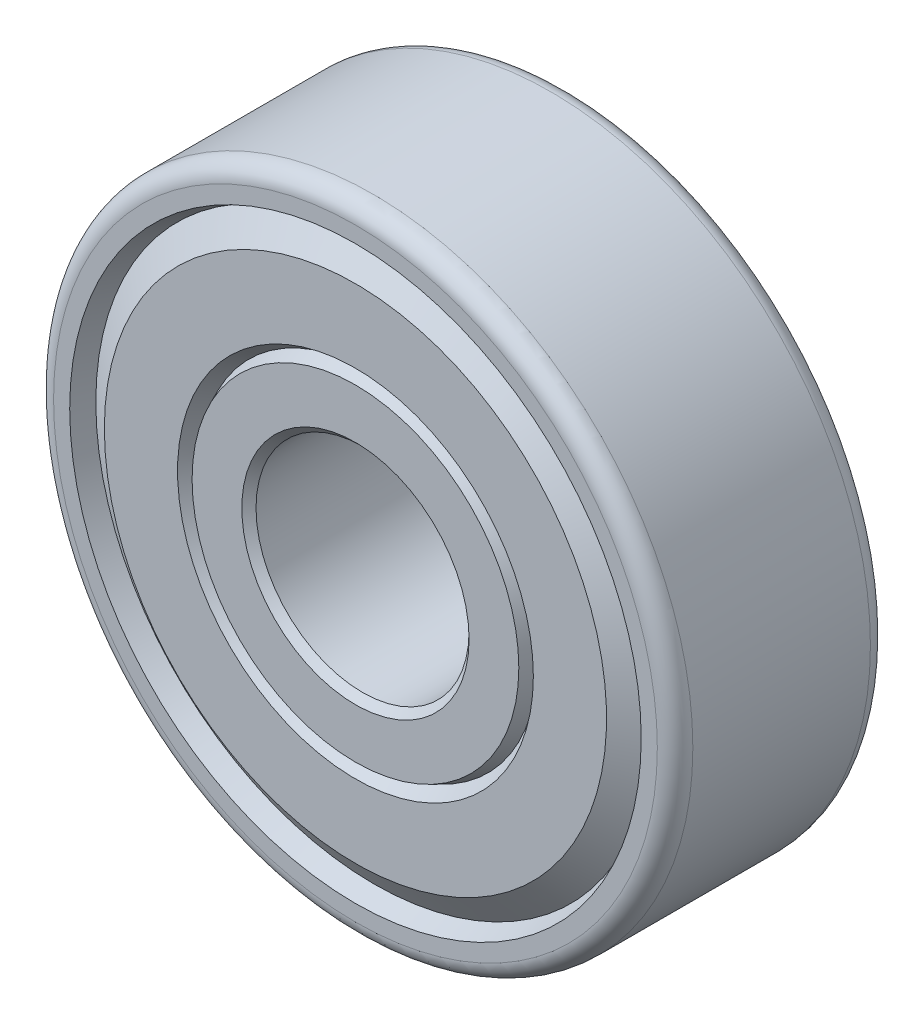
ISO-10303-21;
HEADER;
FILE_DESCRIPTION(('STEP AP214'),'2;1');
FILE_NAME('part.step','',(''),(''),'','','');
FILE_SCHEMA(('AUTOMOTIVE_DESIGN { 1 0 10303 214 1 1 1 1 }'));
ENDSEC;
DATA;
#1=APPLICATION_CONTEXT('core data for automotive mechanical design processes');
#2=APPLICATION_PROTOCOL_DEFINITION('international standard','automotive_design',2000,#1);
#3=PRODUCT_CONTEXT('',#1,'mechanical');
#4=PRODUCT('Part','Part','',(#3));
#5=PRODUCT_RELATED_PRODUCT_CATEGORY('part','',(#4));
#6=PRODUCT_DEFINITION_FORMATION('','',#4);
#7=PRODUCT_DEFINITION_CONTEXT('part definition',#1,'design');
#8=PRODUCT_DEFINITION('design','',#6,#7);
#9=PRODUCT_DEFINITION_SHAPE('','',#8);
#10=(LENGTH_UNIT() NAMED_UNIT(*) SI_UNIT(.MILLI.,.METRE.));
#11=(NAMED_UNIT(*) PLANE_ANGLE_UNIT() SI_UNIT($,.RADIAN.));
#12=(NAMED_UNIT(*) SI_UNIT($,.STERADIAN.) SOLID_ANGLE_UNIT());
#13=UNCERTAINTY_MEASURE_WITH_UNIT(LENGTH_MEASURE(1.E-05),#10,'distance_accuracy_value','');
#14=(GEOMETRIC_REPRESENTATION_CONTEXT(3) GLOBAL_UNCERTAINTY_ASSIGNED_CONTEXT((#13)) GLOBAL_UNIT_ASSIGNED_CONTEXT((#10,
#11,#12)) REPRESENTATION_CONTEXT('',''));
#15=CARTESIAN_POINT('',(0.,0.,0.));
#16=DIRECTION('',(0.,0.,1.));
#17=DIRECTION('',(1.,0.,0.));
#18=AXIS2_PLACEMENT_3D('',#15,#16,#17);
#19=CARTESIAN_POINT('',(0.,0.,0.));
#20=DIRECTION('',(0.,0.,1.));
#21=DIRECTION('',(1.,0.,0.));
#22=AXIS2_PLACEMENT_3D('',#19,#20,#21);
#23=CYLINDRICAL_SURFACE('',#22,4.7625);
#24=CARTESIAN_POINT('',(0.,0.,-4.44499999986192));
#25=DIRECTION('',(0.,0.,-1.));
#26=DIRECTION('',(-1.,0.,0.));
#27=AXIS2_PLACEMENT_3D('',#24,#25,#26);
#28=CIRCLE('',#27,4.76250000008349);
#29=CARTESIAN_POINT('',(-4.76250000008349,0.,-4.44499999986192));
#30=VERTEX_POINT('',#29);
#31=EDGE_CURVE('E317',#30,#30,#28,.T.);
#32=ORIENTED_EDGE('',*,*,#31,.T.);
#33=EDGE_LOOP('',(#32));
#34=FACE_BOUND('',#33,.T.);
#35=CARTESIAN_POINT('',(0.,0.,4.44499999986192));
#36=DIRECTION('',(0.,0.,1.));
#37=DIRECTION('',(-1.,0.,0.));
#38=AXIS2_PLACEMENT_3D('',#35,#36,#37);
#39=CIRCLE('',#38,4.76250000008349);
#40=CARTESIAN_POINT('',(-4.76250000008349,0.,4.44499999986192));
#41=VERTEX_POINT('',#40);
#42=EDGE_CURVE('E320',#41,#41,#39,.T.);
#43=ORIENTED_EDGE('',*,*,#42,.T.);
#44=EDGE_LOOP('',(#43));
#45=FACE_BOUND('',#44,.T.);
#46=ADVANCED_FACE('F14',(#34,#45),#23,.F.);
#47=CARTESIAN_POINT('',(0.,0.,-4.7624999999698));
#48=DIRECTION('',(0.,0.,-1.));
#49=DIRECTION('',(-1.,0.,0.));
#50=AXIS2_PLACEMENT_3D('',#47,#48,#49);
#51=CONICAL_SURFACE('',#50,5.07999999962294,0.785398162502276);
#52=CARTESIAN_POINT('',(0.,0.,-4.76250000008349));
#53=DIRECTION('',(0.,0.,-1.));
#54=DIRECTION('',(-1.,0.,0.));
#55=AXIS2_PLACEMENT_3D('',#52,#53,#54);
#56=CIRCLE('',#55,5.07999999973663);
#57=CARTESIAN_POINT('',(-5.07999999973663,0.,-4.76250000008349));
#58=VERTEX_POINT('',#57);
#59=EDGE_CURVE('E321',#58,#58,#56,.F.);
#60=ORIENTED_EDGE('',*,*,#59,.F.);
#61=EDGE_LOOP('',(#60));
#62=FACE_BOUND('',#61,.T.);
#63=ORIENTED_EDGE('',*,*,#31,.F.);
#64=EDGE_LOOP('',(#63));
#65=FACE_BOUND('',#64,.T.);
#66=ADVANCED_FACE('F246',(#62,#65),#51,.F.);
#67=CARTESIAN_POINT('',(0.,0.,4.7624999999698));
#68=DIRECTION('',(0.,0.,1.));
#69=DIRECTION('',(1.,0.,0.));
#70=AXIS2_PLACEMENT_3D('',#67,#68,#69);
#71=CONICAL_SURFACE('',#70,5.07999999962294,0.785398162502276);
#72=ORIENTED_EDGE('',*,*,#42,.F.);
#73=EDGE_LOOP('',(#72));
#74=FACE_BOUND('',#73,.T.);
#75=CARTESIAN_POINT('',(0.,0.,4.76250000008349));
#76=DIRECTION('',(0.,0.,1.));
#77=DIRECTION('',(1.,0.,0.));
#78=AXIS2_PLACEMENT_3D('',#75,#76,#77);
#79=CIRCLE('',#78,5.07999999973663);
#80=CARTESIAN_POINT('',(5.07999999973663,0.,4.76250000008349));
#81=VERTEX_POINT('',#80);
#82=EDGE_CURVE('E324',#81,#81,#79,.T.);
#83=ORIENTED_EDGE('',*,*,#82,.T.);
#84=EDGE_LOOP('',(#83));
#85=FACE_BOUND('',#84,.T.);
#86=ADVANCED_FACE('F238',(#74,#85),#71,.F.);
#87=CARTESIAN_POINT('',(0.,0.,-4.7625));
#88=DIRECTION('',(0.,0.,-1.));
#89=DIRECTION('',(-1.,0.,0.));
#90=AXIS2_PLACEMENT_3D('',#87,#88,#89);
#91=PLANE('',#90);
#92=ORIENTED_EDGE('',*,*,#59,.T.);
#93=EDGE_LOOP('',(#92));
#94=FACE_BOUND('',#93,.T.);
#95=CARTESIAN_POINT('',(0.,0.,-4.7625));
#96=DIRECTION('',(0.,0.,1.));
#97=DIRECTION('',(1.,0.,0.));
#98=AXIS2_PLACEMENT_3D('',#95,#96,#97);
#99=CIRCLE('',#98,7.3025);
#100=CARTESIAN_POINT('',(7.3025,0.,-4.7625));
#101=VERTEX_POINT('',#100);
#102=EDGE_CURVE('E354',#101,#101,#99,.T.);
#103=ORIENTED_EDGE('',*,*,#102,.F.);
#104=EDGE_LOOP('',(#103));
#105=FACE_BOUND('',#104,.T.);
#106=ADVANCED_FACE('F230',(#94,#105),#91,.T.);
#107=CARTESIAN_POINT('',(0.,0.,4.7625));
#108=DIRECTION('',(0.,0.,-1.));
#109=DIRECTION('',(-1.,0.,0.));
#110=AXIS2_PLACEMENT_3D('',#107,#108,#109);
#111=PLANE('',#110);
#112=ORIENTED_EDGE('',*,*,#82,.F.);
#113=EDGE_LOOP('',(#112));
#114=FACE_BOUND('',#113,.T.);
#115=CARTESIAN_POINT('',(0.,0.,4.76250000005854));
#116=DIRECTION('',(0.,0.,-1.));
#117=DIRECTION('',(-1.,0.,0.));
#118=AXIS2_PLACEMENT_3D('',#115,#116,#117);
#119=CIRCLE('',#118,7.30250000013546);
#120=CARTESIAN_POINT('',(-7.30250000013546,0.,4.76250000005854));
#121=VERTEX_POINT('',#120);
#122=EDGE_CURVE('E351',#121,#121,#119,.T.);
#123=ORIENTED_EDGE('',*,*,#122,.F.);
#124=EDGE_LOOP('',(#123));
#125=FACE_BOUND('',#124,.T.);
#126=ADVANCED_FACE('F222',(#114,#125),#111,.F.);
#127=CARTESIAN_POINT('',(0.,0.,-4.18132890087755));
#128=DIRECTION('',(0.,0.,1.));
#129=DIRECTION('',(1.,0.,0.));
#130=AXIS2_PLACEMENT_3D('',#127,#128,#129);
#131=CONICAL_SURFACE('',#130,7.55365742462336,0.407917424824535);
#132=CARTESIAN_POINT('',(0.,0.,-4.18132890087755));
#133=DIRECTION('',(0.,0.,-1.));
#134=DIRECTION('',(-1.,0.,0.));
#135=AXIS2_PLACEMENT_3D('',#132,#133,#134);
#136=CIRCLE('',#135,7.55365742462337);
#137=CARTESIAN_POINT('',(-7.55365742462337,0.,-4.18132890087755));
#138=VERTEX_POINT('',#137);
#139=EDGE_CURVE('E328',#138,#138,#136,.T.);
#140=ORIENTED_EDGE('',*,*,#139,.T.);
#141=EDGE_LOOP('',(#140));
#142=FACE_BOUND('',#141,.T.);
#143=ORIENTED_EDGE('',*,*,#102,.T.);
#144=EDGE_LOOP('',(#143));
#145=FACE_BOUND('',#144,.T.);
#146=ADVANCED_FACE('F214',(#142,#145),#131,.T.);
#147=CARTESIAN_POINT('',(0.,0.,4.18132890087755));
#148=DIRECTION('',(0.,0.,-1.));
#149=DIRECTION('',(-1.,0.,0.));
#150=AXIS2_PLACEMENT_3D('',#147,#148,#149);
#151=CONICAL_SURFACE('',#150,7.55365742446263,0.407917424358415);
#152=CARTESIAN_POINT('',(0.,0.,4.18132890066575));
#153=DIRECTION('',(0.,0.,1.));
#154=DIRECTION('',(-1.,0.,0.));
#155=AXIS2_PLACEMENT_3D('',#152,#153,#154);
#156=CIRCLE('',#155,7.55365742477154);
#157=CARTESIAN_POINT('',(-7.55365742477154,0.,4.18132890066575));
#158=VERTEX_POINT('',#157);
#159=EDGE_CURVE('E350',#158,#158,#156,.T.);
#160=ORIENTED_EDGE('',*,*,#159,.T.);
#161=EDGE_LOOP('',(#160));
#162=FACE_BOUND('',#161,.T.);
#163=ORIENTED_EDGE('',*,*,#122,.T.);
#164=EDGE_LOOP('',(#163));
#165=FACE_BOUND('',#164,.T.);
#166=ADVANCED_FACE('F206',(#162,#165),#151,.T.);
#167=CARTESIAN_POINT('',(0.,0.,-4.7625));
#168=DIRECTION('',(0.,0.,-1.));
#169=DIRECTION('',(-1.,0.,0.));
#170=AXIS2_PLACEMENT_3D('',#167,#168,#169);
#171=CONICAL_SURFACE('',#170,7.952136972928,0.601029540804804);
#172=ORIENTED_EDGE('',*,*,#139,.F.);
#173=EDGE_LOOP('',(#172));
#174=FACE_BOUND('',#173,.T.);
#175=CARTESIAN_POINT('',(0.,0.,-4.7625));
#176=DIRECTION('',(0.,0.,-1.));
#177=DIRECTION('',(-1.,0.,0.));
#178=AXIS2_PLACEMENT_3D('',#175,#176,#177);
#179=CIRCLE('',#178,7.952136972928);
#180=CARTESIAN_POINT('',(-7.952136972928,0.,-4.7625));
#181=VERTEX_POINT('',#180);
#182=EDGE_CURVE('E347',#181,#181,#179,.F.);
#183=ORIENTED_EDGE('',*,*,#182,.F.);
#184=EDGE_LOOP('',(#183));
#185=FACE_BOUND('',#184,.T.);
#186=ADVANCED_FACE('F198',(#174,#185),#171,.F.);
#187=CARTESIAN_POINT('',(0.,0.,4.7625));
#188=DIRECTION('',(0.,0.,1.));
#189=DIRECTION('',(1.,0.,0.));
#190=AXIS2_PLACEMENT_3D('',#187,#188,#189);
#191=CONICAL_SURFACE('',#190,7.95213697263462,0.601029540118035);
#192=CARTESIAN_POINT('',(0.,0.,4.7625));
#193=DIRECTION('',(0.,0.,1.));
#194=DIRECTION('',(1.,0.,0.));
#195=AXIS2_PLACEMENT_3D('',#192,#193,#194);
#196=CIRCLE('',#195,7.95213697263462);
#197=CARTESIAN_POINT('',(7.95213697263462,0.,4.7625));
#198=VERTEX_POINT('',#197);
#199=EDGE_CURVE('E344',#198,#198,#196,.T.);
#200=ORIENTED_EDGE('',*,*,#199,.T.);
#201=EDGE_LOOP('',(#200));
#202=FACE_BOUND('',#201,.T.);
#203=ORIENTED_EDGE('',*,*,#159,.F.);
#204=EDGE_LOOP('',(#203));
#205=FACE_BOUND('',#204,.T.);
#206=ADVANCED_FACE('F190',(#202,#205),#191,.F.);
#207=CARTESIAN_POINT('',(0.,0.,-4.7625));
#208=DIRECTION('',(0.,0.,-1.));
#209=DIRECTION('',(-1.,0.,0.));
#210=AXIS2_PLACEMENT_3D('',#207,#208,#209);
#211=PLANE('',#210);
#212=ORIENTED_EDGE('',*,*,#182,.T.);
#213=EDGE_LOOP('',(#212));
#214=FACE_BOUND('',#213,.T.);
#215=CARTESIAN_POINT('',(0.,0.,-4.7625));
#216=DIRECTION('',(0.,0.,1.));
#217=DIRECTION('',(1.,0.,0.));
#218=AXIS2_PLACEMENT_3D('',#215,#216,#217);
#219=CIRCLE('',#218,11.2241326943492);
#220=CARTESIAN_POINT('',(11.2241326943492,0.,-4.7625));
#221=VERTEX_POINT('',#220);
#222=EDGE_CURVE('E341',#221,#221,#219,.T.);
#223=ORIENTED_EDGE('',*,*,#222,.F.);
#224=EDGE_LOOP('',(#223));
#225=FACE_BOUND('',#224,.T.);
#226=ADVANCED_FACE('F182',(#214,#225),#211,.T.);
#227=CARTESIAN_POINT('',(0.,0.,4.7625));
#228=DIRECTION('',(0.,0.,-1.));
#229=DIRECTION('',(-1.,0.,0.));
#230=AXIS2_PLACEMENT_3D('',#227,#228,#229);
#231=PLANE('',#230);
#232=ORIENTED_EDGE('',*,*,#199,.F.);
#233=EDGE_LOOP('',(#232));
#234=FACE_BOUND('',#233,.T.);
#235=CARTESIAN_POINT('',(0.,0.,4.76250000067259));
#236=DIRECTION('',(0.,0.,-1.));
#237=DIRECTION('',(-1.,0.,0.));
#238=AXIS2_PLACEMENT_3D('',#235,#236,#237);
#239=CIRCLE('',#238,11.2241326948103);
#240=CARTESIAN_POINT('',(-11.2241326948103,0.,4.76250000067259));
#241=VERTEX_POINT('',#240);
#242=EDGE_CURVE('E337',#241,#241,#239,.T.);
#243=ORIENTED_EDGE('',*,*,#242,.F.);
#244=EDGE_LOOP('',(#243));
#245=FACE_BOUND('',#244,.T.);
#246=ADVANCED_FACE('F174',(#234,#245),#231,.F.);
#247=CARTESIAN_POINT('',(0.,0.,-3.93017144225871));
#248=DIRECTION('',(0.,0.,1.));
#249=DIRECTION('',(1.,0.,0.));
#250=AXIS2_PLACEMENT_3D('',#247,#248,#249);
#251=CONICAL_SURFACE('',#250,12.4380602466955,0.969766785990084);
#252=CARTESIAN_POINT('',(0.,0.,-3.93017144225872));
#253=DIRECTION('',(0.,0.,-1.));
#254=DIRECTION('',(-1.,0.,0.));
#255=AXIS2_PLACEMENT_3D('',#252,#253,#254);
#256=CIRCLE('',#255,12.4380602466955);
#257=CARTESIAN_POINT('',(-12.4380602466955,0.,-3.93017144225872));
#258=VERTEX_POINT('',#257);
#259=EDGE_CURVE('E340',#258,#258,#256,.T.);
#260=ORIENTED_EDGE('',*,*,#259,.T.);
#261=EDGE_LOOP('',(#260));
#262=FACE_BOUND('',#261,.T.);
#263=ORIENTED_EDGE('',*,*,#222,.T.);
#264=EDGE_LOOP('',(#263));
#265=FACE_BOUND('',#264,.T.);
#266=ADVANCED_FACE('F166',(#262,#265),#251,.T.);
#267=CARTESIAN_POINT('',(0.,0.,3.93017144225871));
#268=DIRECTION('',(0.,0.,-1.));
#269=DIRECTION('',(-1.,0.,0.));
#270=AXIS2_PLACEMENT_3D('',#267,#268,#269);
#271=CONICAL_SURFACE('',#270,12.4380602452534,0.969766784881962);
#272=CARTESIAN_POINT('',(0.,0.,3.93017144168615));
#273=DIRECTION('',(0.,0.,1.));
#274=DIRECTION('',(-1.,0.,0.));
#275=AXIS2_PLACEMENT_3D('',#272,#273,#274);
#276=CIRCLE('',#275,12.4380602466765);
#277=CARTESIAN_POINT('',(-12.4380602466765,0.,3.93017144168615));
#278=VERTEX_POINT('',#277);
#279=EDGE_CURVE('E336',#278,#278,#276,.T.);
#280=ORIENTED_EDGE('',*,*,#279,.T.);
#281=EDGE_LOOP('',(#280));
#282=FACE_BOUND('',#281,.T.);
#283=ORIENTED_EDGE('',*,*,#242,.T.);
#284=EDGE_LOOP('',(#283));
#285=FACE_BOUND('',#284,.T.);
#286=ADVANCED_FACE('F158',(#282,#285),#271,.T.);
#287=CARTESIAN_POINT('',(0.,0.,-4.7625));
#288=DIRECTION('',(0.,0.,-1.));
#289=DIRECTION('',(-1.,0.,0.));
#290=AXIS2_PLACEMENT_3D('',#287,#288,#289);
#291=CONICAL_SURFACE('',#290,12.7729368128599,0.382519398268516);
#292=ORIENTED_EDGE('',*,*,#259,.F.);
#293=EDGE_LOOP('',(#292));
#294=FACE_BOUND('',#293,.T.);
#295=CARTESIAN_POINT('',(0.,0.,-4.7625));
#296=DIRECTION('',(0.,0.,-1.));
#297=DIRECTION('',(-1.,0.,0.));
#298=AXIS2_PLACEMENT_3D('',#295,#296,#297);
#299=CIRCLE('',#298,12.7729368128599);
#300=CARTESIAN_POINT('',(-12.7729368128599,0.,-4.7625));
#301=VERTEX_POINT('',#300);
#302=EDGE_CURVE('E333',#301,#301,#299,.F.);
#303=ORIENTED_EDGE('',*,*,#302,.F.);
#304=EDGE_LOOP('',(#303));
#305=FACE_BOUND('',#304,.T.);
#306=ADVANCED_FACE('F150',(#294,#305),#291,.F.);
#307=CARTESIAN_POINT('',(0.,0.,4.7625));
#308=DIRECTION('',(0.,0.,1.));
#309=DIRECTION('',(1.,0.,0.));
#310=AXIS2_PLACEMENT_3D('',#307,#308,#309);
#311=CONICAL_SURFACE('',#310,12.7729368126486,0.382519397831445);
#312=CARTESIAN_POINT('',(0.,0.,4.7625));
#313=DIRECTION('',(0.,0.,1.));
#314=DIRECTION('',(1.,0.,0.));
#315=AXIS2_PLACEMENT_3D('',#312,#313,#314);
#316=CIRCLE('',#315,12.7729368126486);
#317=CARTESIAN_POINT('',(12.7729368126486,0.,4.7625));
#318=VERTEX_POINT('',#317);
#319=EDGE_CURVE('E49',#318,#318,#316,.T.);
#320=ORIENTED_EDGE('',*,*,#319,.T.);
#321=EDGE_LOOP('',(#320));
#322=FACE_BOUND('',#321,.T.);
#323=ORIENTED_EDGE('',*,*,#279,.F.);
#324=EDGE_LOOP('',(#323));
#325=FACE_BOUND('',#324,.T.);
#326=ADVANCED_FACE('F143',(#322,#325),#311,.F.);
#327=CARTESIAN_POINT('',(0.,0.,-4.7625));
#328=DIRECTION('',(0.,0.,-1.));
#329=DIRECTION('',(-1.,0.,0.));
#330=AXIS2_PLACEMENT_3D('',#327,#328,#329);
#331=PLANE('',#330);
#332=ORIENTED_EDGE('',*,*,#302,.T.);
#333=EDGE_LOOP('',(#332));
#334=FACE_BOUND('',#333,.T.);
#335=CARTESIAN_POINT('',(0.,0.,-4.76249999999999));
#336=DIRECTION('',(0.,0.,1.));
#337=DIRECTION('',(1.,0.,0.));
#338=AXIS2_PLACEMENT_3D('',#335,#336,#337);
#339=CIRCLE('',#338,13.49375);
#340=CARTESIAN_POINT('',(13.49375,0.,-4.7625));
#341=VERTEX_POINT('',#340);
#342=CARTESIAN_POINT('',(-13.49375,0.,-4.7625));
#343=VERTEX_POINT('',#342);
#344=EDGE_CURVE('E42',#341,#343,#339,.T.);
#345=ORIENTED_EDGE('',*,*,#344,.F.);
#346=CARTESIAN_POINT('',(0.,0.,-4.76249999999999));
#347=DIRECTION('',(0.,0.,1.));
#348=DIRECTION('',(-1.,0.,0.));
#349=AXIS2_PLACEMENT_3D('',#346,#347,#348);
#350=CIRCLE('',#349,13.49375);
#351=EDGE_CURVE('E47',#343,#341,#350,.T.);
#352=ORIENTED_EDGE('',*,*,#351,.F.);
#353=EDGE_LOOP('',(#345,#352));
#354=FACE_BOUND('',#353,.T.);
#355=ADVANCED_FACE('F46',(#334,#354),#331,.T.);
#356=CARTESIAN_POINT('',(0.,0.,4.7625));
#357=DIRECTION('',(0.,0.,-1.));
#358=DIRECTION('',(-1.,0.,0.));
#359=AXIS2_PLACEMENT_3D('',#356,#357,#358);
#360=PLANE('',#359);
#361=ORIENTED_EDGE('',*,*,#319,.F.);
#362=EDGE_LOOP('',(#361));
#363=FACE_BOUND('',#362,.T.);
#364=CARTESIAN_POINT('',(0.,0.,4.76250000000002));
#365=DIRECTION('',(0.,0.,-1.));
#366=DIRECTION('',(1.,0.,0.));
#367=AXIS2_PLACEMENT_3D('',#364,#365,#366);
#368=CIRCLE('',#367,13.49375);
#369=CARTESIAN_POINT('',(13.49375,0.,4.76250000000001));
#370=VERTEX_POINT('',#369);
#371=CARTESIAN_POINT('',(-13.49375,0.,4.76250000000001));
#372=VERTEX_POINT('',#371);
#373=EDGE_CURVE('E54',#370,#372,#368,.T.);
#374=ORIENTED_EDGE('',*,*,#373,.F.);
#375=CARTESIAN_POINT('',(0.,0.,4.76250000000002));
#376=DIRECTION('',(0.,0.,-1.));
#377=DIRECTION('',(-1.,0.,0.));
#378=AXIS2_PLACEMENT_3D('',#375,#376,#377);
#379=CIRCLE('',#378,13.49375);
#380=EDGE_CURVE('E33',#372,#370,#379,.T.);
#381=ORIENTED_EDGE('',*,*,#380,.F.);
#382=EDGE_LOOP('',(#374,#381));
#383=FACE_BOUND('',#382,.T.);
#384=ADVANCED_FACE('F75',(#363,#383),#360,.F.);
#385=CARTESIAN_POINT('',(0.,0.,-3.96874999999999));
#386=DIRECTION('',(0.,0.,1.));
#387=DIRECTION('',(1.,0.,0.));
#388=AXIS2_PLACEMENT_3D('',#385,#386,#387);
#389=TOROIDAL_SURFACE('',#388,13.49375,0.79375);
#390=ORIENTED_EDGE('',*,*,#344,.T.);
#391=ORIENTED_EDGE('',*,*,#351,.T.);
#392=EDGE_LOOP('',(#390,#391));
#393=FACE_BOUND('',#392,.T.);
#394=CARTESIAN_POINT('',(0.,0.,-3.96874999999999));
#395=DIRECTION('',(0.,0.,1.));
#396=DIRECTION('',(1.,0.,0.));
#397=AXIS2_PLACEMENT_3D('',#394,#395,#396);
#398=CIRCLE('',#397,14.2875);
#399=CARTESIAN_POINT('',(14.2875,0.,-3.96874999999999));
#400=VERTEX_POINT('',#399);
#401=EDGE_CURVE('E25',#400,#400,#398,.T.);
#402=ORIENTED_EDGE('',*,*,#401,.F.);
#403=EDGE_LOOP('',(#402));
#404=FACE_BOUND('',#403,.T.);
#405=ADVANCED_FACE('F52',(#393,#404),#389,.T.);
#406=CARTESIAN_POINT('',(0.,0.,3.96875000000002));
#407=DIRECTION('',(0.,0.,-1.));
#408=DIRECTION('',(-1.,0.,0.));
#409=AXIS2_PLACEMENT_3D('',#406,#407,#408);
#410=TOROIDAL_SURFACE('',#409,13.49375,0.79375);
#411=ORIENTED_EDGE('',*,*,#380,.T.);
#412=ORIENTED_EDGE('',*,*,#373,.T.);
#413=EDGE_LOOP('',(#411,#412));
#414=FACE_BOUND('',#413,.T.);
#415=CARTESIAN_POINT('',(0.,0.,3.96875000000002));
#416=DIRECTION('',(0.,0.,1.));
#417=DIRECTION('',(1.,0.,0.));
#418=AXIS2_PLACEMENT_3D('',#415,#416,#417);
#419=CIRCLE('',#418,14.2875);
#420=CARTESIAN_POINT('',(14.2875,0.,3.96875000000002));
#421=VERTEX_POINT('',#420);
#422=EDGE_CURVE('E9',#421,#421,#419,.F.);
#423=ORIENTED_EDGE('',*,*,#422,.F.);
#424=EDGE_LOOP('',(#423));
#425=FACE_BOUND('',#424,.T.);
#426=ADVANCED_FACE('F74',(#414,#425),#410,.T.);
#427=CARTESIAN_POINT('',(0.,0.,0.));
#428=DIRECTION('',(0.,0.,1.));
#429=DIRECTION('',(1.,0.,0.));
#430=AXIS2_PLACEMENT_3D('',#427,#428,#429);
#431=CYLINDRICAL_SURFACE('',#430,14.2875);
#432=ORIENTED_EDGE('',*,*,#422,.T.);
#433=EDGE_LOOP('',(#432));
#434=FACE_BOUND('',#433,.T.);
#435=ORIENTED_EDGE('',*,*,#401,.T.);
#436=EDGE_LOOP('',(#435));
#437=FACE_BOUND('',#436,.T.);
#438=ADVANCED_FACE('F115',(#434,#437),#431,.T.);
#439=CLOSED_SHELL('',(#46,#66,#86,#106,#126,#146,#166,#186,#206,#226,#246,#266,#286,#306,#326,
#355,#384,#405,#426,#438));
#440=MANIFOLD_SOLID_BREP('B1',#439);
#441=ADVANCED_BREP_SHAPE_REPRESENTATION('',(#18,#440),#14);
#442=SHAPE_DEFINITION_REPRESENTATION(#9,#441);
ENDSEC;
END-ISO-10303-21;
